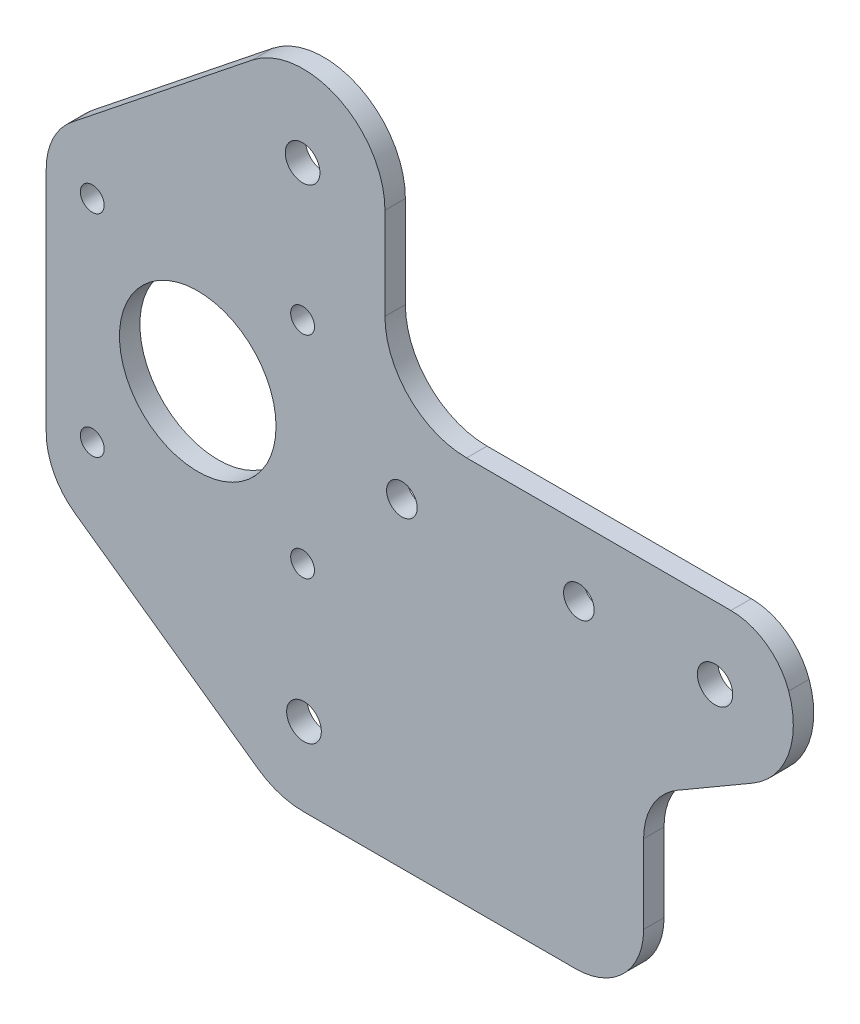
ISO-10303-21;
HEADER;
FILE_DESCRIPTION(('STEP AP214'),'2;1');
FILE_NAME('part.step','',(''),(''),'','','');
FILE_SCHEMA(('AUTOMOTIVE_DESIGN { 1 0 10303 214 1 1 1 1 }'));
ENDSEC;
DATA;
#1=APPLICATION_CONTEXT('core data for automotive mechanical design processes');
#2=APPLICATION_PROTOCOL_DEFINITION('international standard','automotive_design',2000,#1);
#3=PRODUCT_CONTEXT('',#1,'mechanical');
#4=PRODUCT('Part','Part','',(#3));
#5=PRODUCT_RELATED_PRODUCT_CATEGORY('part','',(#4));
#6=PRODUCT_DEFINITION_FORMATION('','',#4);
#7=PRODUCT_DEFINITION_CONTEXT('part definition',#1,'design');
#8=PRODUCT_DEFINITION('design','',#6,#7);
#9=PRODUCT_DEFINITION_SHAPE('','',#8);
#10=(LENGTH_UNIT() NAMED_UNIT(*) SI_UNIT(.MILLI.,.METRE.));
#11=(NAMED_UNIT(*) PLANE_ANGLE_UNIT() SI_UNIT($,.RADIAN.));
#12=(NAMED_UNIT(*) SI_UNIT($,.STERADIAN.) SOLID_ANGLE_UNIT());
#13=UNCERTAINTY_MEASURE_WITH_UNIT(LENGTH_MEASURE(1.E-05),#10,'distance_accuracy_value','');
#14=(GEOMETRIC_REPRESENTATION_CONTEXT(3) GLOBAL_UNCERTAINTY_ASSIGNED_CONTEXT((#13)) GLOBAL_UNIT_ASSIGNED_CONTEXT((#10,
#11,#12)) REPRESENTATION_CONTEXT('',''));
#15=CARTESIAN_POINT('',(0.,0.,0.));
#16=DIRECTION('',(0.,0.,1.));
#17=DIRECTION('',(1.,0.,0.));
#18=AXIS2_PLACEMENT_3D('',#15,#16,#17);
#19=CARTESIAN_POINT('',(20.0949887053272,70.8510693839283,3.));
#20=DIRECTION('',(0.,0.,-1.));
#21=DIRECTION('',(-1.,0.,0.));
#22=AXIS2_PLACEMENT_3D('',#19,#20,#21);
#23=PLANE('',#22);
#24=CARTESIAN_POINT('',(20.0949887053272,70.8510693839283,3.));
#25=DIRECTION('',(0.,0.,1.));
#26=DIRECTION('',(-1.,0.,0.));
#27=AXIS2_PLACEMENT_3D('',#24,#25,#26);
#28=CIRCLE('',#27,12.);
#29=CARTESIAN_POINT('',(32.0949887053272,70.8510693839283,3.));
#30=VERTEX_POINT('',#29);
#31=CARTESIAN_POINT('',(12.6113055582922,80.2316070313547,3.));
#32=VERTEX_POINT('',#31);
#33=EDGE_CURVE('E245',#30,#32,#28,.T.);
#34=ORIENTED_EDGE('',*,*,#33,.T.);
#35=DIRECTION('',(-0.781711470618866,-0.623640262252919,0.));
#36=VECTOR('',#35,1.);
#37=CARTESIAN_POINT('',(-13.9043475250998,59.0777293357357,3.));
#38=LINE('',#37,#36);
#39=CARTESIAN_POINT('',(-13.9043475250998,59.0777293357357,3.));
#40=VERTEX_POINT('',#39);
#41=EDGE_CURVE('E134',#32,#40,#38,.T.);
#42=ORIENTED_EDGE('',*,*,#41,.T.);
#43=CARTESIAN_POINT('',(-7.66794490257056,51.260614629547,3.));
#44=DIRECTION('',(0.,0.,1.));
#45=DIRECTION('',(-1.,0.,0.));
#46=AXIS2_PLACEMENT_3D('',#43,#44,#45);
#47=CIRCLE('',#46,10.);
#48=CARTESIAN_POINT('',(-17.6679449025706,51.260614629547,3.));
#49=VERTEX_POINT('',#48);
#50=EDGE_CURVE('E294',#40,#49,#47,.T.);
#51=ORIENTED_EDGE('',*,*,#50,.T.);
#52=DIRECTION('',(0.,-1.,0.));
#53=VECTOR('',#52,1.);
#54=CARTESIAN_POINT('',(-17.6679449025706,51.260614629547,3.));
#55=LINE('',#54,#53);
#56=CARTESIAN_POINT('',(-17.6679449025706,17.690614629547,3.));
#57=VERTEX_POINT('',#56);
#58=EDGE_CURVE('E313',#49,#57,#55,.T.);
#59=ORIENTED_EDGE('',*,*,#58,.T.);
#60=CARTESIAN_POINT('',(-7.66794490257056,17.690614629547,3.));
#61=DIRECTION('',(0.,0.,1.));
#62=DIRECTION('',(-1.,0.,0.));
#63=AXIS2_PLACEMENT_3D('',#60,#61,#62);
#64=CIRCLE('',#63,10.);
#65=CARTESIAN_POINT('',(-13.4499842307973,9.53169183258174,3.));
#66=VERTEX_POINT('',#65);
#67=EDGE_CURVE('E310',#57,#66,#64,.T.);
#68=ORIENTED_EDGE('',*,*,#67,.T.);
#69=DIRECTION('',(0.815892279696527,-0.578203932822671,0.));
#70=VECTOR('',#69,1.);
#71=CARTESIAN_POINT('',(13.4499842307973,-9.53169183258175,3.));
#72=LINE('',#71,#70);
#73=CARTESIAN_POINT('',(13.4499842307973,-9.53169183258175,3.));
#74=VERTEX_POINT('',#73);
#75=EDGE_CURVE('E312',#66,#74,#72,.T.);
#76=ORIENTED_EDGE('',*,*,#75,.T.);
#77=CARTESIAN_POINT('',(20.099329458258,-0.148930616071687,3.));
#78=DIRECTION('',(0.,0.,1.));
#79=DIRECTION('',(-1.,0.,0.));
#80=AXIS2_PLACEMENT_3D('',#77,#78,#79);
#81=CIRCLE('',#80,11.5);
#82=CARTESIAN_POINT('',(20.099329458258,-11.6489306160717,3.));
#83=VERTEX_POINT('',#82);
#84=EDGE_CURVE('E316',#74,#83,#81,.T.);
#85=ORIENTED_EDGE('',*,*,#84,.T.);
#86=DIRECTION('',(1.,0.,0.));
#87=VECTOR('',#86,1.);
#88=CARTESIAN_POINT('',(60.099329458258,-11.6489306160717,3.));
#89=LINE('',#88,#87);
#90=CARTESIAN_POINT('',(60.099329458258,-11.6489306160717,3.));
#91=VERTEX_POINT('',#90);
#92=EDGE_CURVE('E324',#83,#91,#89,.T.);
#93=ORIENTED_EDGE('',*,*,#92,.T.);
#94=CARTESIAN_POINT('',(60.099329458258,-1.64893061607167,3.));
#95=DIRECTION('',(0.,0.,1.));
#96=DIRECTION('',(-1.,0.,0.));
#97=AXIS2_PLACEMENT_3D('',#94,#95,#96);
#98=CIRCLE('',#97,10.);
#99=CARTESIAN_POINT('',(70.099329458258,-1.64893061607167,3.));
#100=VERTEX_POINT('',#99);
#101=EDGE_CURVE('E327',#91,#100,#98,.T.);
#102=ORIENTED_EDGE('',*,*,#101,.T.);
#103=DIRECTION('',(0.,1.,0.));
#104=VECTOR('',#103,1.);
#105=CARTESIAN_POINT('',(70.099329458258,9.90106938392833,3.));
#106=LINE('',#105,#104);
#107=CARTESIAN_POINT('',(70.099329458258,9.90106938392833,3.));
#108=VERTEX_POINT('',#107);
#109=EDGE_CURVE('E330',#100,#108,#106,.T.);
#110=ORIENTED_EDGE('',*,*,#109,.T.);
#111=CARTESIAN_POINT('',(80.099329458258,9.90106938392833,3.));
#112=DIRECTION('',(0.,0.,-1.));
#113=DIRECTION('',(-1.,0.,0.));
#114=AXIS2_PLACEMENT_3D('',#111,#112,#113);
#115=CIRCLE('',#114,9.99999999999999);
#116=CARTESIAN_POINT('',(75.0691299919557,18.5438174034654,3.));
#117=VERTEX_POINT('',#116);
#118=EDGE_CURVE('E332',#108,#117,#115,.T.);
#119=ORIENTED_EDGE('',*,*,#118,.T.);
#120=DIRECTION('',(0.864274801953706,0.503019946630232,0.));
#121=VECTOR('',#120,1.);
#122=CARTESIAN_POINT('',(86.1318474569631,24.9824727203324,3.));
#123=LINE('',#122,#121);
#124=CARTESIAN_POINT('',(86.1318474569631,24.9824727203324,3.));
#125=VERTEX_POINT('',#124);
#126=EDGE_CURVE('E334',#117,#125,#123,.T.);
#127=ORIENTED_EDGE('',*,*,#126,.T.);
#128=CARTESIAN_POINT('',(80.0956080974003,35.3537703437768,3.));
#129=DIRECTION('',(0.,0.,1.));
#130=DIRECTION('',(-1.,0.,0.));
#131=AXIS2_PLACEMENT_3D('',#128,#129,#130);
#132=CIRCLE('',#131,12.);
#133=CARTESIAN_POINT('',(91.413130529108,39.3429665043828,3.));
#134=VERTEX_POINT('',#133);
#135=EDGE_CURVE('E336',#125,#134,#132,.T.);
#136=ORIENTED_EDGE('',*,*,#135,.T.);
#137=CARTESIAN_POINT('',(82.9249887053272,36.3510693839283,3.));
#138=DIRECTION('',(0.,0.,1.));
#139=DIRECTION('',(-1.,0.,0.));
#140=AXIS2_PLACEMENT_3D('',#137,#138,#139);
#141=CIRCLE('',#140,9.00000000000003);
#142=CARTESIAN_POINT('',(82.9249887053273,45.3510693839284,3.));
#143=VERTEX_POINT('',#142);
#144=EDGE_CURVE('E185',#134,#143,#141,.T.);
#145=ORIENTED_EDGE('',*,*,#144,.T.);
#146=DIRECTION('',(-1.,0.,0.));
#147=VECTOR('',#146,1.);
#148=CARTESIAN_POINT('',(44.0949887053273,45.3510693839283,3.));
#149=LINE('',#148,#147);
#150=CARTESIAN_POINT('',(44.0949887053273,45.3510693839283,3.));
#151=VERTEX_POINT('',#150);
#152=EDGE_CURVE('E179',#143,#151,#149,.T.);
#153=ORIENTED_EDGE('',*,*,#152,.T.);
#154=CARTESIAN_POINT('',(44.0949887053272,57.3510693839283,3.));
#155=DIRECTION('',(0.,0.,-1.));
#156=DIRECTION('',(-1.,0.,0.));
#157=AXIS2_PLACEMENT_3D('',#154,#155,#156);
#158=CIRCLE('',#157,12.);
#159=CARTESIAN_POINT('',(32.0949887053272,57.3510693839283,3.));
#160=VERTEX_POINT('',#159);
#161=EDGE_CURVE('E183',#151,#160,#158,.T.);
#162=ORIENTED_EDGE('',*,*,#161,.T.);
#163=DIRECTION('',(0.,1.,0.));
#164=VECTOR('',#163,1.);
#165=CARTESIAN_POINT('',(32.0949887053272,70.8510693839283,3.));
#166=LINE('',#165,#164);
#167=EDGE_CURVE('E58',#160,#30,#166,.T.);
#168=ORIENTED_EDGE('',*,*,#167,.T.);
#169=EDGE_LOOP('',(#34,#42,#51,#59,#68,#76,#85,#93,#102,#110,#119,#127,#136,#145,#153,#162,#168));
#170=FACE_BOUND('',#169,.T.);
#171=CARTESIAN_POINT('',(60.5847639602232,35.3510693839283,3.));
#172=DIRECTION('',(0.,0.,1.));
#173=DIRECTION('',(1.,0.,0.));
#174=AXIS2_PLACEMENT_3D('',#171,#172,#173);
#175=CIRCLE('',#174,2.24999999999999);
#176=CARTESIAN_POINT('',(62.8347639602232,35.3510693839283,3.));
#177=VERTEX_POINT('',#176);
#178=EDGE_CURVE('E208',#177,#177,#175,.T.);
#179=ORIENTED_EDGE('',*,*,#178,.F.);
#180=EDGE_LOOP('',(#179));
#181=FACE_BOUND('',#180,.T.);
#182=CARTESIAN_POINT('',(80.5947639602231,34.7806705055204,3.));
#183=DIRECTION('',(0.,0.,1.));
#184=DIRECTION('',(1.,0.,0.));
#185=AXIS2_PLACEMENT_3D('',#182,#183,#184);
#186=CIRCLE('',#185,2.6);
#187=CARTESIAN_POINT('',(83.1947639602232,34.7806705055204,3.));
#188=VERTEX_POINT('',#187);
#189=EDGE_CURVE('E467',#188,#188,#186,.T.);
#190=ORIENTED_EDGE('',*,*,#189,.F.);
#191=EDGE_LOOP('',(#190));
#192=FACE_BOUND('',#191,.T.);
#193=CARTESIAN_POINT('',(4.59205509742945,35.3482997800071,3.));
#194=DIRECTION('',(0.,0.,1.));
#195=DIRECTION('',(1.,0.,0.));
#196=AXIS2_PLACEMENT_3D('',#193,#194,#195);
#197=CIRCLE('',#196,11.5);
#198=CARTESIAN_POINT('',(16.0920550974295,35.3482997800071,3.));
#199=VERTEX_POINT('',#198);
#200=EDGE_CURVE('E459',#199,#199,#197,.T.);
#201=ORIENTED_EDGE('',*,*,#200,.F.);
#202=EDGE_LOOP('',(#201));
#203=FACE_BOUND('',#202,.T.);
#204=CARTESIAN_POINT('',(19.9949887541267,70.8509705917557,3.));
#205=DIRECTION('',(0.,0.,1.));
#206=DIRECTION('',(1.,0.,0.));
#207=AXIS2_PLACEMENT_3D('',#204,#205,#206);
#208=CIRCLE('',#207,2.54999999999999);
#209=CARTESIAN_POINT('',(22.5449887541267,70.8509705917557,3.));
#210=VERTEX_POINT('',#209);
#211=EDGE_CURVE('E453',#210,#210,#208,.T.);
#212=ORIENTED_EDGE('',*,*,#211,.F.);
#213=EDGE_LOOP('',(#212));
#214=FACE_BOUND('',#213,.T.);
#215=CARTESIAN_POINT('',(34.5847657629751,35.3413872820056,3.));
#216=DIRECTION('',(0.,0.,1.));
#217=DIRECTION('',(1.,0.,0.));
#218=AXIS2_PLACEMENT_3D('',#215,#216,#217);
#219=CIRCLE('',#218,2.25090238289014);
#220=CARTESIAN_POINT('',(36.8356681458653,35.3413872820056,3.));
#221=VERTEX_POINT('',#220);
#222=EDGE_CURVE('E447',#221,#221,#219,.T.);
#223=ORIENTED_EDGE('',*,*,#222,.F.);
#224=EDGE_LOOP('',(#223));
#225=FACE_BOUND('',#224,.T.);
#226=CARTESIAN_POINT('',(20.1993294094585,-0.149029408244336,3.));
#227=DIRECTION('',(0.,0.,1.));
#228=DIRECTION('',(1.,0.,0.));
#229=AXIS2_PLACEMENT_3D('',#226,#227,#228);
#230=CIRCLE('',#229,2.55);
#231=CARTESIAN_POINT('',(22.7493294094585,-0.149029408244336,3.));
#232=VERTEX_POINT('',#231);
#233=EDGE_CURVE('E439',#232,#232,#230,.T.);
#234=ORIENTED_EDGE('',*,*,#233,.F.);
#235=EDGE_LOOP('',(#234));
#236=FACE_BOUND('',#235,.T.);
#237=CARTESIAN_POINT('',(19.9920550974294,19.8510693839283,3.));
#238=DIRECTION('',(0.,0.,1.));
#239=DIRECTION('',(1.,0.,0.));
#240=AXIS2_PLACEMENT_3D('',#237,#238,#239);
#241=CIRCLE('',#240,1.75);
#242=CARTESIAN_POINT('',(21.7420550974294,19.8510693839283,3.));
#243=VERTEX_POINT('',#242);
#244=EDGE_CURVE('E433',#243,#243,#241,.T.);
#245=ORIENTED_EDGE('',*,*,#244,.F.);
#246=EDGE_LOOP('',(#245));
#247=FACE_BOUND('',#246,.T.);
#248=CARTESIAN_POINT('',(-10.9079449025705,19.8510693839283,3.));
#249=DIRECTION('',(0.,0.,1.));
#250=DIRECTION('',(1.,0.,0.));
#251=AXIS2_PLACEMENT_3D('',#248,#249,#250);
#252=CIRCLE('',#251,1.75);
#253=CARTESIAN_POINT('',(-9.15794490257054,19.8510693839283,3.));
#254=VERTEX_POINT('',#253);
#255=EDGE_CURVE('E427',#254,#254,#252,.T.);
#256=ORIENTED_EDGE('',*,*,#255,.F.);
#257=EDGE_LOOP('',(#256));
#258=FACE_BOUND('',#257,.T.);
#259=CARTESIAN_POINT('',(-10.9079449025705,50.8510693839283,3.));
#260=DIRECTION('',(0.,0.,1.));
#261=DIRECTION('',(1.,0.,0.));
#262=AXIS2_PLACEMENT_3D('',#259,#260,#261);
#263=CIRCLE('',#262,1.75);
#264=CARTESIAN_POINT('',(-9.15794490257054,50.8510693839283,3.));
#265=VERTEX_POINT('',#264);
#266=EDGE_CURVE('E419',#265,#265,#263,.T.);
#267=ORIENTED_EDGE('',*,*,#266,.F.);
#268=EDGE_LOOP('',(#267));
#269=FACE_BOUND('',#268,.T.);
#270=CARTESIAN_POINT('',(19.9920550974294,50.8510693839283,3.));
#271=DIRECTION('',(0.,0.,1.));
#272=DIRECTION('',(1.,0.,0.));
#273=AXIS2_PLACEMENT_3D('',#270,#271,#272);
#274=CIRCLE('',#273,1.75);
#275=CARTESIAN_POINT('',(21.7420550974294,50.8510693839283,3.));
#276=VERTEX_POINT('',#275);
#277=EDGE_CURVE('E409',#276,#276,#274,.T.);
#278=ORIENTED_EDGE('',*,*,#277,.F.);
#279=EDGE_LOOP('',(#278));
#280=FACE_BOUND('',#279,.T.);
#281=ADVANCED_FACE('F40',(#170,#181,#192,#203,#214,#225,#236,#247,#258,#269,#280),#23,.F.);
#282=CARTESIAN_POINT('',(20.0949887053272,70.8510693839283,0.));
#283=DIRECTION('',(0.,0.,-1.));
#284=DIRECTION('',(-1.,0.,0.));
#285=AXIS2_PLACEMENT_3D('',#282,#283,#284);
#286=PLANE('',#285);
#287=CARTESIAN_POINT('',(-10.9079449025705,50.8510693839283,0.));
#288=DIRECTION('',(0.,0.,1.));
#289=DIRECTION('',(1.,0.,0.));
#290=AXIS2_PLACEMENT_3D('',#287,#288,#289);
#291=CIRCLE('',#290,1.75);
#292=CARTESIAN_POINT('',(-9.15794490257054,50.8510693839283,0.));
#293=VERTEX_POINT('',#292);
#294=EDGE_CURVE('E416',#293,#293,#291,.T.);
#295=ORIENTED_EDGE('',*,*,#294,.T.);
#296=EDGE_LOOP('',(#295));
#297=FACE_BOUND('',#296,.T.);
#298=CARTESIAN_POINT('',(19.9920550974294,19.8510693839283,0.));
#299=DIRECTION('',(0.,0.,1.));
#300=DIRECTION('',(1.,0.,0.));
#301=AXIS2_PLACEMENT_3D('',#298,#299,#300);
#302=CIRCLE('',#301,1.75);
#303=CARTESIAN_POINT('',(21.7420550974294,19.8510693839283,0.));
#304=VERTEX_POINT('',#303);
#305=EDGE_CURVE('E430',#304,#304,#302,.T.);
#306=ORIENTED_EDGE('',*,*,#305,.T.);
#307=EDGE_LOOP('',(#306));
#308=FACE_BOUND('',#307,.T.);
#309=CARTESIAN_POINT('',(34.5847657629751,35.3413872820056,0.));
#310=DIRECTION('',(0.,0.,1.));
#311=DIRECTION('',(1.,0.,0.));
#312=AXIS2_PLACEMENT_3D('',#309,#310,#311);
#313=CIRCLE('',#312,2.25090238289014);
#314=CARTESIAN_POINT('',(36.8356681458653,35.3413872820056,0.));
#315=VERTEX_POINT('',#314);
#316=EDGE_CURVE('E443',#315,#315,#313,.T.);
#317=ORIENTED_EDGE('',*,*,#316,.T.);
#318=EDGE_LOOP('',(#317));
#319=FACE_BOUND('',#318,.T.);
#320=CARTESIAN_POINT('',(4.59205509742945,35.3482997800071,0.));
#321=DIRECTION('',(0.,0.,1.));
#322=DIRECTION('',(1.,0.,0.));
#323=AXIS2_PLACEMENT_3D('',#320,#321,#322);
#324=CIRCLE('',#323,11.5);
#325=CARTESIAN_POINT('',(16.0920550974295,35.3482997800071,0.));
#326=VERTEX_POINT('',#325);
#327=EDGE_CURVE('E456',#326,#326,#324,.T.);
#328=ORIENTED_EDGE('',*,*,#327,.T.);
#329=EDGE_LOOP('',(#328));
#330=FACE_BOUND('',#329,.T.);
#331=CARTESIAN_POINT('',(60.5847639602232,35.3510693839283,0.));
#332=DIRECTION('',(0.,0.,1.));
#333=DIRECTION('',(1.,0.,0.));
#334=AXIS2_PLACEMENT_3D('',#331,#332,#333);
#335=CIRCLE('',#334,2.24999999999999);
#336=CARTESIAN_POINT('',(62.8347639602232,35.3510693839283,0.));
#337=VERTEX_POINT('',#336);
#338=EDGE_CURVE('E470',#337,#337,#335,.T.);
#339=ORIENTED_EDGE('',*,*,#338,.T.);
#340=EDGE_LOOP('',(#339));
#341=FACE_BOUND('',#340,.T.);
#342=CARTESIAN_POINT('',(20.0949887053272,70.8510693839283,0.));
#343=DIRECTION('',(0.,0.,1.));
#344=DIRECTION('',(-1.,0.,0.));
#345=AXIS2_PLACEMENT_3D('',#342,#343,#344);
#346=CIRCLE('',#345,12.);
#347=CARTESIAN_POINT('',(32.0949887053272,70.8510693839283,0.));
#348=VERTEX_POINT('',#347);
#349=CARTESIAN_POINT('',(12.6113055582922,80.2316070313547,0.));
#350=VERTEX_POINT('',#349);
#351=EDGE_CURVE('E204',#348,#350,#346,.T.);
#352=ORIENTED_EDGE('',*,*,#351,.F.);
#353=DIRECTION('',(0.,1.,0.));
#354=VECTOR('',#353,1.);
#355=CARTESIAN_POINT('',(32.0949887053272,70.8510693839283,0.));
#356=LINE('',#355,#354);
#357=CARTESIAN_POINT('',(32.0949887053272,57.3510693839283,0.));
#358=VERTEX_POINT('',#357);
#359=EDGE_CURVE('E125',#358,#348,#356,.T.);
#360=ORIENTED_EDGE('',*,*,#359,.F.);
#361=CARTESIAN_POINT('',(44.0949887053272,57.3510693839283,0.));
#362=DIRECTION('',(0.,0.,-1.));
#363=DIRECTION('',(-1.,0.,0.));
#364=AXIS2_PLACEMENT_3D('',#361,#362,#363);
#365=CIRCLE('',#364,12.);
#366=CARTESIAN_POINT('',(44.0949887053273,45.3510693839283,0.));
#367=VERTEX_POINT('',#366);
#368=EDGE_CURVE('E119',#367,#358,#365,.T.);
#369=ORIENTED_EDGE('',*,*,#368,.F.);
#370=DIRECTION('',(-1.,0.,0.));
#371=VECTOR('',#370,1.);
#372=CARTESIAN_POINT('',(44.0949887053273,45.3510693839283,0.));
#373=LINE('',#372,#371);
#374=CARTESIAN_POINT('',(82.9249887053273,45.3510693839284,0.));
#375=VERTEX_POINT('',#374);
#376=EDGE_CURVE('E194',#375,#367,#373,.T.);
#377=ORIENTED_EDGE('',*,*,#376,.F.);
#378=CARTESIAN_POINT('',(82.9249887053272,36.3510693839283,0.));
#379=DIRECTION('',(0.,0.,1.));
#380=DIRECTION('',(-1.,0.,0.));
#381=AXIS2_PLACEMENT_3D('',#378,#379,#380);
#382=CIRCLE('',#381,9.00000000000003);
#383=CARTESIAN_POINT('',(91.413130529108,39.3429665043828,0.));
#384=VERTEX_POINT('',#383);
#385=EDGE_CURVE('E239',#384,#375,#382,.T.);
#386=ORIENTED_EDGE('',*,*,#385,.F.);
#387=CARTESIAN_POINT('',(80.0956080974003,35.3537703437768,0.));
#388=DIRECTION('',(0.,0.,1.));
#389=DIRECTION('',(-1.,0.,0.));
#390=AXIS2_PLACEMENT_3D('',#387,#388,#389);
#391=CIRCLE('',#390,12.);
#392=CARTESIAN_POINT('',(86.1318474569631,24.9824727203324,0.));
#393=VERTEX_POINT('',#392);
#394=EDGE_CURVE('E237',#393,#384,#391,.T.);
#395=ORIENTED_EDGE('',*,*,#394,.F.);
#396=DIRECTION('',(0.864274801953706,0.503019946630232,0.));
#397=VECTOR('',#396,1.);
#398=CARTESIAN_POINT('',(86.1318474569631,24.9824727203324,0.));
#399=LINE('',#398,#397);
#400=CARTESIAN_POINT('',(75.0691299919557,18.5438174034654,0.));
#401=VERTEX_POINT('',#400);
#402=EDGE_CURVE('E235',#401,#393,#399,.T.);
#403=ORIENTED_EDGE('',*,*,#402,.F.);
#404=CARTESIAN_POINT('',(80.099329458258,9.90106938392833,0.));
#405=DIRECTION('',(0.,0.,-1.));
#406=DIRECTION('',(-1.,0.,0.));
#407=AXIS2_PLACEMENT_3D('',#404,#405,#406);
#408=CIRCLE('',#407,9.99999999999999);
#409=CARTESIAN_POINT('',(70.099329458258,9.90106938392833,0.));
#410=VERTEX_POINT('',#409);
#411=EDGE_CURVE('E233',#410,#401,#408,.T.);
#412=ORIENTED_EDGE('',*,*,#411,.F.);
#413=DIRECTION('',(0.,1.,0.));
#414=VECTOR('',#413,1.);
#415=CARTESIAN_POINT('',(70.099329458258,9.90106938392833,0.));
#416=LINE('',#415,#414);
#417=CARTESIAN_POINT('',(70.099329458258,-1.64893061607167,0.));
#418=VERTEX_POINT('',#417);
#419=EDGE_CURVE('E231',#418,#410,#416,.T.);
#420=ORIENTED_EDGE('',*,*,#419,.F.);
#421=CARTESIAN_POINT('',(60.099329458258,-1.64893061607167,0.));
#422=DIRECTION('',(0.,0.,1.));
#423=DIRECTION('',(-1.,0.,0.));
#424=AXIS2_PLACEMENT_3D('',#421,#422,#423);
#425=CIRCLE('',#424,10.);
#426=CARTESIAN_POINT('',(60.099329458258,-11.6489306160717,0.));
#427=VERTEX_POINT('',#426);
#428=EDGE_CURVE('E228',#427,#418,#425,.T.);
#429=ORIENTED_EDGE('',*,*,#428,.F.);
#430=DIRECTION('',(1.,0.,0.));
#431=VECTOR('',#430,1.);
#432=CARTESIAN_POINT('',(60.099329458258,-11.6489306160717,0.));
#433=LINE('',#432,#431);
#434=CARTESIAN_POINT('',(20.099329458258,-11.6489306160717,0.));
#435=VERTEX_POINT('',#434);
#436=EDGE_CURVE('E225',#435,#427,#433,.T.);
#437=ORIENTED_EDGE('',*,*,#436,.F.);
#438=CARTESIAN_POINT('',(20.099329458258,-0.148930616071687,0.));
#439=DIRECTION('',(0.,0.,1.));
#440=DIRECTION('',(-1.,0.,0.));
#441=AXIS2_PLACEMENT_3D('',#438,#439,#440);
#442=CIRCLE('',#441,11.5);
#443=CARTESIAN_POINT('',(13.4499842307973,-9.53169183258175,0.));
#444=VERTEX_POINT('',#443);
#445=EDGE_CURVE('E222',#444,#435,#442,.T.);
#446=ORIENTED_EDGE('',*,*,#445,.F.);
#447=DIRECTION('',(0.815892279696527,-0.578203932822671,0.));
#448=VECTOR('',#447,1.);
#449=CARTESIAN_POINT('',(13.4499842307973,-9.53169183258175,0.));
#450=LINE('',#449,#448);
#451=CARTESIAN_POINT('',(-13.4499842307973,9.53169183258174,0.));
#452=VERTEX_POINT('',#451);
#453=EDGE_CURVE('E219',#452,#444,#450,.T.);
#454=ORIENTED_EDGE('',*,*,#453,.F.);
#455=CARTESIAN_POINT('',(-7.66794490257056,17.690614629547,0.));
#456=DIRECTION('',(0.,0.,1.));
#457=DIRECTION('',(-1.,0.,0.));
#458=AXIS2_PLACEMENT_3D('',#455,#456,#457);
#459=CIRCLE('',#458,10.);
#460=CARTESIAN_POINT('',(-17.6679449025706,17.690614629547,0.));
#461=VERTEX_POINT('',#460);
#462=EDGE_CURVE('E217',#461,#452,#459,.T.);
#463=ORIENTED_EDGE('',*,*,#462,.F.);
#464=DIRECTION('',(0.,-1.,0.));
#465=VECTOR('',#464,1.);
#466=CARTESIAN_POINT('',(-17.6679449025706,51.260614629547,0.));
#467=LINE('',#466,#465);
#468=CARTESIAN_POINT('',(-17.6679449025706,51.260614629547,0.));
#469=VERTEX_POINT('',#468);
#470=EDGE_CURVE('E214',#469,#461,#467,.T.);
#471=ORIENTED_EDGE('',*,*,#470,.F.);
#472=CARTESIAN_POINT('',(-7.66794490257056,51.260614629547,0.));
#473=DIRECTION('',(0.,0.,1.));
#474=DIRECTION('',(-1.,0.,0.));
#475=AXIS2_PLACEMENT_3D('',#472,#473,#474);
#476=CIRCLE('',#475,10.);
#477=CARTESIAN_POINT('',(-13.9043475250998,59.0777293357357,0.));
#478=VERTEX_POINT('',#477);
#479=EDGE_CURVE('E211',#478,#469,#476,.T.);
#480=ORIENTED_EDGE('',*,*,#479,.F.);
#481=DIRECTION('',(-0.781711470618866,-0.623640262252919,0.));
#482=VECTOR('',#481,1.);
#483=CARTESIAN_POINT('',(-13.9043475250998,59.0777293357357,0.));
#484=LINE('',#483,#482);
#485=EDGE_CURVE('E207',#350,#478,#484,.T.);
#486=ORIENTED_EDGE('',*,*,#485,.F.);
#487=EDGE_LOOP('',(#352,#360,#369,#377,#386,#395,#403,#412,#420,#429,#437,#446,#454,#463,#471,
#480,#486));
#488=FACE_BOUND('',#487,.T.);
#489=CARTESIAN_POINT('',(80.5947639602231,34.7806705055204,0.));
#490=DIRECTION('',(0.,0.,1.));
#491=DIRECTION('',(1.,0.,0.));
#492=AXIS2_PLACEMENT_3D('',#489,#490,#491);
#493=CIRCLE('',#492,2.6);
#494=CARTESIAN_POINT('',(83.1947639602232,34.7806705055204,0.));
#495=VERTEX_POINT('',#494);
#496=EDGE_CURVE('E463',#495,#495,#493,.T.);
#497=ORIENTED_EDGE('',*,*,#496,.T.);
#498=EDGE_LOOP('',(#497));
#499=FACE_BOUND('',#498,.T.);
#500=CARTESIAN_POINT('',(19.9949887541267,70.8509705917557,0.));
#501=DIRECTION('',(0.,0.,1.));
#502=DIRECTION('',(1.,0.,0.));
#503=AXIS2_PLACEMENT_3D('',#500,#501,#502);
#504=CIRCLE('',#503,2.54999999999999);
#505=CARTESIAN_POINT('',(22.5449887541267,70.8509705917557,0.));
#506=VERTEX_POINT('',#505);
#507=EDGE_CURVE('E450',#506,#506,#504,.T.);
#508=ORIENTED_EDGE('',*,*,#507,.T.);
#509=EDGE_LOOP('',(#508));
#510=FACE_BOUND('',#509,.T.);
#511=CARTESIAN_POINT('',(20.1993294094585,-0.149029408244336,0.));
#512=DIRECTION('',(0.,0.,1.));
#513=DIRECTION('',(1.,0.,0.));
#514=AXIS2_PLACEMENT_3D('',#511,#512,#513);
#515=CIRCLE('',#514,2.55);
#516=CARTESIAN_POINT('',(22.7493294094585,-0.149029408244336,0.));
#517=VERTEX_POINT('',#516);
#518=EDGE_CURVE('E436',#517,#517,#515,.T.);
#519=ORIENTED_EDGE('',*,*,#518,.T.);
#520=EDGE_LOOP('',(#519));
#521=FACE_BOUND('',#520,.T.);
#522=CARTESIAN_POINT('',(-10.9079449025705,19.8510693839283,0.));
#523=DIRECTION('',(0.,0.,1.));
#524=DIRECTION('',(1.,0.,0.));
#525=AXIS2_PLACEMENT_3D('',#522,#523,#524);
#526=CIRCLE('',#525,1.75);
#527=CARTESIAN_POINT('',(-9.15794490257054,19.8510693839283,0.));
#528=VERTEX_POINT('',#527);
#529=EDGE_CURVE('E423',#528,#528,#526,.T.);
#530=ORIENTED_EDGE('',*,*,#529,.T.);
#531=EDGE_LOOP('',(#530));
#532=FACE_BOUND('',#531,.T.);
#533=CARTESIAN_POINT('',(19.9920550974294,50.8510693839283,0.));
#534=DIRECTION('',(0.,0.,1.));
#535=DIRECTION('',(1.,0.,0.));
#536=AXIS2_PLACEMENT_3D('',#533,#534,#535);
#537=CIRCLE('',#536,1.75);
#538=CARTESIAN_POINT('',(21.7420550974294,50.8510693839283,0.));
#539=VERTEX_POINT('',#538);
#540=EDGE_CURVE('E412',#539,#539,#537,.T.);
#541=ORIENTED_EDGE('',*,*,#540,.T.);
#542=EDGE_LOOP('',(#541));
#543=FACE_BOUND('',#542,.T.);
#544=ADVANCED_FACE('F298',(#297,#308,#319,#330,#341,#488,#499,#510,#521,#532,#543),#286,.T.);
#545=CARTESIAN_POINT('',(20.0949887053272,70.8510693839283,3.));
#546=DIRECTION('',(0.,0.,-1.));
#547=DIRECTION('',(-1.,0.,0.));
#548=AXIS2_PLACEMENT_3D('',#545,#546,#547);
#549=CYLINDRICAL_SURFACE('',#548,12.);
#550=ORIENTED_EDGE('',*,*,#351,.T.);
#551=DIRECTION('',(0.,0.,-1.));
#552=VECTOR('',#551,1.);
#553=CARTESIAN_POINT('',(12.6113055582922,80.2316070313547,3.));
#554=LINE('',#553,#552);
#555=EDGE_CURVE('E11',#32,#350,#554,.T.);
#556=ORIENTED_EDGE('',*,*,#555,.F.);
#557=ORIENTED_EDGE('',*,*,#33,.F.);
#558=DIRECTION('',(0.,0.,-1.));
#559=VECTOR('',#558,1.);
#560=CARTESIAN_POINT('',(32.0949887053272,70.8510693839283,3.));
#561=LINE('',#560,#559);
#562=EDGE_CURVE('E200',#30,#348,#561,.T.);
#563=ORIENTED_EDGE('',*,*,#562,.T.);
#564=EDGE_LOOP('',(#550,#556,#557,#563));
#565=FACE_BOUND('',#564,.T.);
#566=ADVANCED_FACE('F42',(#565),#549,.T.);
#567=CARTESIAN_POINT('',(-13.9043475250998,59.0777293357357,3.));
#568=DIRECTION('',(0.623640262252919,-0.781711470618866,0.));
#569=DIRECTION('',(0.781711470618866,0.623640262252919,0.));
#570=AXIS2_PLACEMENT_3D('',#567,#568,#569);
#571=PLANE('',#570);
#572=ORIENTED_EDGE('',*,*,#485,.T.);
#573=DIRECTION('',(0.,0.,-1.));
#574=VECTOR('',#573,1.);
#575=CARTESIAN_POINT('',(-13.9043475250998,59.0777293357357,3.));
#576=LINE('',#575,#574);
#577=EDGE_CURVE('E50',#40,#478,#576,.T.);
#578=ORIENTED_EDGE('',*,*,#577,.F.);
#579=ORIENTED_EDGE('',*,*,#41,.F.);
#580=ORIENTED_EDGE('',*,*,#555,.T.);
#581=EDGE_LOOP('',(#572,#578,#579,#580));
#582=FACE_BOUND('',#581,.T.);
#583=ADVANCED_FACE('F711',(#582),#571,.F.);
#584=CARTESIAN_POINT('',(-7.66794490257056,51.260614629547,3.));
#585=DIRECTION('',(0.,0.,-1.));
#586=DIRECTION('',(-1.,0.,0.));
#587=AXIS2_PLACEMENT_3D('',#584,#585,#586);
#588=CYLINDRICAL_SURFACE('',#587,10.);
#589=ORIENTED_EDGE('',*,*,#479,.T.);
#590=DIRECTION('',(0.,0.,-1.));
#591=VECTOR('',#590,1.);
#592=CARTESIAN_POINT('',(-17.6679449025706,51.260614629547,3.));
#593=LINE('',#592,#591);
#594=EDGE_CURVE('E282',#49,#469,#593,.T.);
#595=ORIENTED_EDGE('',*,*,#594,.F.);
#596=ORIENTED_EDGE('',*,*,#50,.F.);
#597=ORIENTED_EDGE('',*,*,#577,.T.);
#598=EDGE_LOOP('',(#589,#595,#596,#597));
#599=FACE_BOUND('',#598,.T.);
#600=ADVANCED_FACE('F292',(#599),#588,.T.);
#601=CARTESIAN_POINT('',(-17.6679449025706,51.260614629547,3.));
#602=DIRECTION('',(1.,0.,0.));
#603=DIRECTION('',(0.,1.,0.));
#604=AXIS2_PLACEMENT_3D('',#601,#602,#603);
#605=PLANE('',#604);
#606=ORIENTED_EDGE('',*,*,#470,.T.);
#607=DIRECTION('',(0.,0.,-1.));
#608=VECTOR('',#607,1.);
#609=CARTESIAN_POINT('',(-17.6679449025706,17.690614629547,3.));
#610=LINE('',#609,#608);
#611=EDGE_CURVE('E279',#57,#461,#610,.T.);
#612=ORIENTED_EDGE('',*,*,#611,.F.);
#613=ORIENTED_EDGE('',*,*,#58,.F.);
#614=ORIENTED_EDGE('',*,*,#594,.T.);
#615=EDGE_LOOP('',(#606,#612,#613,#614));
#616=FACE_BOUND('',#615,.T.);
#617=ADVANCED_FACE('F304',(#616),#605,.F.);
#618=CARTESIAN_POINT('',(-7.66794490257056,17.690614629547,3.));
#619=DIRECTION('',(0.,0.,-1.));
#620=DIRECTION('',(-1.,0.,0.));
#621=AXIS2_PLACEMENT_3D('',#618,#619,#620);
#622=CYLINDRICAL_SURFACE('',#621,10.);
#623=ORIENTED_EDGE('',*,*,#462,.T.);
#624=DIRECTION('',(0.,0.,-1.));
#625=VECTOR('',#624,1.);
#626=CARTESIAN_POINT('',(-13.4499842307973,9.53169183258174,3.));
#627=LINE('',#626,#625);
#628=EDGE_CURVE('E276',#66,#452,#627,.T.);
#629=ORIENTED_EDGE('',*,*,#628,.F.);
#630=ORIENTED_EDGE('',*,*,#67,.F.);
#631=ORIENTED_EDGE('',*,*,#611,.T.);
#632=EDGE_LOOP('',(#623,#629,#630,#631));
#633=FACE_BOUND('',#632,.T.);
#634=ADVANCED_FACE('F308',(#633),#622,.T.);
#635=CARTESIAN_POINT('',(13.4499842307973,-9.53169183258175,3.));
#636=DIRECTION('',(0.578203932822671,0.815892279696527,0.));
#637=DIRECTION('',(-0.815892279696527,0.578203932822671,0.));
#638=AXIS2_PLACEMENT_3D('',#635,#636,#637);
#639=PLANE('',#638);
#640=ORIENTED_EDGE('',*,*,#453,.T.);
#641=DIRECTION('',(0.,0.,-1.));
#642=VECTOR('',#641,1.);
#643=CARTESIAN_POINT('',(13.4499842307973,-9.53169183258175,3.));
#644=LINE('',#643,#642);
#645=EDGE_CURVE('E272',#74,#444,#644,.T.);
#646=ORIENTED_EDGE('',*,*,#645,.F.);
#647=ORIENTED_EDGE('',*,*,#75,.F.);
#648=ORIENTED_EDGE('',*,*,#628,.T.);
#649=EDGE_LOOP('',(#640,#646,#647,#648));
#650=FACE_BOUND('',#649,.T.);
#651=ADVANCED_FACE('F568',(#650),#639,.F.);
#652=CARTESIAN_POINT('',(20.099329458258,-0.148930616071687,3.));
#653=DIRECTION('',(0.,0.,-1.));
#654=DIRECTION('',(-1.,0.,0.));
#655=AXIS2_PLACEMENT_3D('',#652,#653,#654);
#656=CYLINDRICAL_SURFACE('',#655,11.5);
#657=ORIENTED_EDGE('',*,*,#445,.T.);
#658=DIRECTION('',(0.,0.,-1.));
#659=VECTOR('',#658,1.);
#660=CARTESIAN_POINT('',(20.099329458258,-11.6489306160717,3.));
#661=LINE('',#660,#659);
#662=EDGE_CURVE('E268',#83,#435,#661,.T.);
#663=ORIENTED_EDGE('',*,*,#662,.F.);
#664=ORIENTED_EDGE('',*,*,#84,.F.);
#665=ORIENTED_EDGE('',*,*,#645,.T.);
#666=EDGE_LOOP('',(#657,#663,#664,#665));
#667=FACE_BOUND('',#666,.T.);
#668=ADVANCED_FACE('F572',(#667),#656,.T.);
#669=CARTESIAN_POINT('',(60.099329458258,-11.6489306160717,3.));
#670=DIRECTION('',(0.,1.,0.));
#671=DIRECTION('',(-1.,0.,0.));
#672=AXIS2_PLACEMENT_3D('',#669,#670,#671);
#673=PLANE('',#672);
#674=ORIENTED_EDGE('',*,*,#436,.T.);
#675=DIRECTION('',(0.,0.,-1.));
#676=VECTOR('',#675,1.);
#677=CARTESIAN_POINT('',(60.099329458258,-11.6489306160717,3.));
#678=LINE('',#677,#676);
#679=EDGE_CURVE('E264',#91,#427,#678,.T.);
#680=ORIENTED_EDGE('',*,*,#679,.F.);
#681=ORIENTED_EDGE('',*,*,#92,.F.);
#682=ORIENTED_EDGE('',*,*,#662,.T.);
#683=EDGE_LOOP('',(#674,#680,#681,#682));
#684=FACE_BOUND('',#683,.T.);
#685=ADVANCED_FACE('F582',(#684),#673,.F.);
#686=CARTESIAN_POINT('',(60.099329458258,-1.64893061607167,3.));
#687=DIRECTION('',(0.,0.,-1.));
#688=DIRECTION('',(-1.,0.,0.));
#689=AXIS2_PLACEMENT_3D('',#686,#687,#688);
#690=CYLINDRICAL_SURFACE('',#689,10.);
#691=ORIENTED_EDGE('',*,*,#428,.T.);
#692=DIRECTION('',(0.,0.,-1.));
#693=VECTOR('',#692,1.);
#694=CARTESIAN_POINT('',(70.099329458258,-1.64893061607167,3.));
#695=LINE('',#694,#693);
#696=EDGE_CURVE('E261',#100,#418,#695,.T.);
#697=ORIENTED_EDGE('',*,*,#696,.F.);
#698=ORIENTED_EDGE('',*,*,#101,.F.);
#699=ORIENTED_EDGE('',*,*,#679,.T.);
#700=EDGE_LOOP('',(#691,#697,#698,#699));
#701=FACE_BOUND('',#700,.T.);
#702=ADVANCED_FACE('F592',(#701),#690,.T.);
#703=CARTESIAN_POINT('',(70.099329458258,9.90106938392833,3.));
#704=DIRECTION('',(-1.,0.,0.));
#705=DIRECTION('',(0.,-1.,0.));
#706=AXIS2_PLACEMENT_3D('',#703,#704,#705);
#707=PLANE('',#706);
#708=ORIENTED_EDGE('',*,*,#419,.T.);
#709=DIRECTION('',(0.,0.,-1.));
#710=VECTOR('',#709,1.);
#711=CARTESIAN_POINT('',(70.099329458258,9.90106938392833,3.));
#712=LINE('',#711,#710);
#713=EDGE_CURVE('E258',#108,#410,#712,.T.);
#714=ORIENTED_EDGE('',*,*,#713,.F.);
#715=ORIENTED_EDGE('',*,*,#109,.F.);
#716=ORIENTED_EDGE('',*,*,#696,.T.);
#717=EDGE_LOOP('',(#708,#714,#715,#716));
#718=FACE_BOUND('',#717,.T.);
#719=ADVANCED_FACE('F600',(#718),#707,.F.);
#720=CARTESIAN_POINT('',(80.099329458258,9.90106938392833,3.));
#721=DIRECTION('',(0.,0.,-1.));
#722=DIRECTION('',(-1.,0.,0.));
#723=AXIS2_PLACEMENT_3D('',#720,#721,#722);
#724=CYLINDRICAL_SURFACE('',#723,9.99999999999999);
#725=ORIENTED_EDGE('',*,*,#411,.T.);
#726=DIRECTION('',(0.,0.,-1.));
#727=VECTOR('',#726,1.);
#728=CARTESIAN_POINT('',(75.0691299919557,18.5438174034654,3.));
#729=LINE('',#728,#727);
#730=EDGE_CURVE('E255',#117,#401,#729,.T.);
#731=ORIENTED_EDGE('',*,*,#730,.F.);
#732=ORIENTED_EDGE('',*,*,#118,.F.);
#733=ORIENTED_EDGE('',*,*,#713,.T.);
#734=EDGE_LOOP('',(#725,#731,#732,#733));
#735=FACE_BOUND('',#734,.T.);
#736=ADVANCED_FACE('F608',(#735),#724,.F.);
#737=CARTESIAN_POINT('',(86.1318474569631,24.9824727203324,3.));
#738=DIRECTION('',(-0.503019946630232,0.864274801953706,0.));
#739=DIRECTION('',(-0.864274801953707,-0.503019946630232,0.));
#740=AXIS2_PLACEMENT_3D('',#737,#738,#739);
#741=PLANE('',#740);
#742=ORIENTED_EDGE('',*,*,#402,.T.);
#743=DIRECTION('',(0.,0.,-1.));
#744=VECTOR('',#743,1.);
#745=CARTESIAN_POINT('',(86.1318474569631,24.9824727203324,3.));
#746=LINE('',#745,#744);
#747=EDGE_CURVE('E252',#125,#393,#746,.T.);
#748=ORIENTED_EDGE('',*,*,#747,.F.);
#749=ORIENTED_EDGE('',*,*,#126,.F.);
#750=ORIENTED_EDGE('',*,*,#730,.T.);
#751=EDGE_LOOP('',(#742,#748,#749,#750));
#752=FACE_BOUND('',#751,.T.);
#753=ADVANCED_FACE('F616',(#752),#741,.F.);
#754=CARTESIAN_POINT('',(80.0956080974003,35.3537703437768,3.));
#755=DIRECTION('',(0.,0.,-1.));
#756=DIRECTION('',(-1.,0.,0.));
#757=AXIS2_PLACEMENT_3D('',#754,#755,#756);
#758=CYLINDRICAL_SURFACE('',#757,12.);
#759=ORIENTED_EDGE('',*,*,#394,.T.);
#760=DIRECTION('',(0.,0.,-1.));
#761=VECTOR('',#760,1.);
#762=CARTESIAN_POINT('',(91.413130529108,39.3429665043828,3.));
#763=LINE('',#762,#761);
#764=EDGE_CURVE('E249',#134,#384,#763,.T.);
#765=ORIENTED_EDGE('',*,*,#764,.F.);
#766=ORIENTED_EDGE('',*,*,#135,.F.);
#767=ORIENTED_EDGE('',*,*,#747,.T.);
#768=EDGE_LOOP('',(#759,#765,#766,#767));
#769=FACE_BOUND('',#768,.T.);
#770=ADVANCED_FACE('F342',(#769),#758,.T.);
#771=CARTESIAN_POINT('',(82.9249887053272,36.3510693839283,3.));
#772=DIRECTION('',(0.,0.,-1.));
#773=DIRECTION('',(-1.,0.,0.));
#774=AXIS2_PLACEMENT_3D('',#771,#772,#773);
#775=CYLINDRICAL_SURFACE('',#774,9.00000000000003);
#776=ORIENTED_EDGE('',*,*,#385,.T.);
#777=DIRECTION('',(0.,0.,-1.));
#778=VECTOR('',#777,1.);
#779=CARTESIAN_POINT('',(82.9249887053273,45.3510693839284,3.));
#780=LINE('',#779,#778);
#781=EDGE_CURVE('E195',#143,#375,#780,.T.);
#782=ORIENTED_EDGE('',*,*,#781,.F.);
#783=ORIENTED_EDGE('',*,*,#144,.F.);
#784=ORIENTED_EDGE('',*,*,#764,.T.);
#785=EDGE_LOOP('',(#776,#782,#783,#784));
#786=FACE_BOUND('',#785,.T.);
#787=ADVANCED_FACE('F346',(#786),#775,.T.);
#788=CARTESIAN_POINT('',(44.0949887053273,45.3510693839283,3.));
#789=DIRECTION('',(0.,-1.,0.));
#790=DIRECTION('',(1.,0.,0.));
#791=AXIS2_PLACEMENT_3D('',#788,#789,#790);
#792=PLANE('',#791);
#793=ORIENTED_EDGE('',*,*,#376,.T.);
#794=DIRECTION('',(0.,0.,-1.));
#795=VECTOR('',#794,1.);
#796=CARTESIAN_POINT('',(44.0949887053273,45.3510693839283,3.));
#797=LINE('',#796,#795);
#798=EDGE_CURVE('E191',#151,#367,#797,.T.);
#799=ORIENTED_EDGE('',*,*,#798,.F.);
#800=ORIENTED_EDGE('',*,*,#152,.F.);
#801=ORIENTED_EDGE('',*,*,#781,.T.);
#802=EDGE_LOOP('',(#793,#799,#800,#801));
#803=FACE_BOUND('',#802,.T.);
#804=ADVANCED_FACE('F192',(#803),#792,.F.);
#805=CARTESIAN_POINT('',(44.0949887053272,57.3510693839283,3.));
#806=DIRECTION('',(0.,0.,-1.));
#807=DIRECTION('',(-1.,0.,0.));
#808=AXIS2_PLACEMENT_3D('',#805,#806,#807);
#809=CYLINDRICAL_SURFACE('',#808,12.);
#810=ORIENTED_EDGE('',*,*,#368,.T.);
#811=DIRECTION('',(0.,0.,-1.));
#812=VECTOR('',#811,1.);
#813=CARTESIAN_POINT('',(32.0949887053272,57.3510693839283,3.));
#814=LINE('',#813,#812);
#815=EDGE_CURVE('E196',#160,#358,#814,.T.);
#816=ORIENTED_EDGE('',*,*,#815,.F.);
#817=ORIENTED_EDGE('',*,*,#161,.F.);
#818=ORIENTED_EDGE('',*,*,#798,.T.);
#819=EDGE_LOOP('',(#810,#816,#817,#818));
#820=FACE_BOUND('',#819,.T.);
#821=ADVANCED_FACE('F198',(#820),#809,.F.);
#822=CARTESIAN_POINT('',(32.0949887053272,70.8510693839283,3.));
#823=DIRECTION('',(-1.,0.,0.));
#824=DIRECTION('',(0.,-1.,0.));
#825=AXIS2_PLACEMENT_3D('',#822,#823,#824);
#826=PLANE('',#825);
#827=ORIENTED_EDGE('',*,*,#359,.T.);
#828=ORIENTED_EDGE('',*,*,#562,.F.);
#829=ORIENTED_EDGE('',*,*,#167,.F.);
#830=ORIENTED_EDGE('',*,*,#815,.T.);
#831=EDGE_LOOP('',(#827,#828,#829,#830));
#832=FACE_BOUND('',#831,.T.);
#833=ADVANCED_FACE('F350',(#832),#826,.F.);
#834=CARTESIAN_POINT('',(60.5847639602232,35.3510693839283,3.));
#835=DIRECTION('',(0.,0.,-1.));
#836=DIRECTION('',(-1.,0.,0.));
#837=AXIS2_PLACEMENT_3D('',#834,#835,#836);
#838=CYLINDRICAL_SURFACE('',#837,2.24999999999999);
#839=ORIENTED_EDGE('',*,*,#178,.T.);
#840=EDGE_LOOP('',(#839));
#841=FACE_BOUND('',#840,.T.);
#842=ORIENTED_EDGE('',*,*,#338,.F.);
#843=EDGE_LOOP('',(#842));
#844=FACE_BOUND('',#843,.T.);
#845=ADVANCED_FACE('F352',(#841,#844),#838,.F.);
#846=CARTESIAN_POINT('',(80.5947639602231,34.7806705055204,3.));
#847=DIRECTION('',(0.,0.,-1.));
#848=DIRECTION('',(-1.,0.,0.));
#849=AXIS2_PLACEMENT_3D('',#846,#847,#848);
#850=CYLINDRICAL_SURFACE('',#849,2.6);
#851=ORIENTED_EDGE('',*,*,#189,.T.);
#852=EDGE_LOOP('',(#851));
#853=FACE_BOUND('',#852,.T.);
#854=ORIENTED_EDGE('',*,*,#496,.F.);
#855=EDGE_LOOP('',(#854));
#856=FACE_BOUND('',#855,.T.);
#857=ADVANCED_FACE('F358',(#853,#856),#850,.F.);
#858=CARTESIAN_POINT('',(4.59205509742945,35.3482997800071,3.));
#859=DIRECTION('',(0.,0.,-1.));
#860=DIRECTION('',(-1.,0.,0.));
#861=AXIS2_PLACEMENT_3D('',#858,#859,#860);
#862=CYLINDRICAL_SURFACE('',#861,11.5);
#863=ORIENTED_EDGE('',*,*,#200,.T.);
#864=EDGE_LOOP('',(#863));
#865=FACE_BOUND('',#864,.T.);
#866=ORIENTED_EDGE('',*,*,#327,.F.);
#867=EDGE_LOOP('',(#866));
#868=FACE_BOUND('',#867,.T.);
#869=ADVANCED_FACE('F372',(#865,#868),#862,.F.);
#870=CARTESIAN_POINT('',(19.9949887541267,70.8509705917557,3.));
#871=DIRECTION('',(0.,0.,-1.));
#872=DIRECTION('',(-1.,0.,0.));
#873=AXIS2_PLACEMENT_3D('',#870,#871,#872);
#874=CYLINDRICAL_SURFACE('',#873,2.54999999999999);
#875=ORIENTED_EDGE('',*,*,#211,.T.);
#876=EDGE_LOOP('',(#875));
#877=FACE_BOUND('',#876,.T.);
#878=ORIENTED_EDGE('',*,*,#507,.F.);
#879=EDGE_LOOP('',(#878));
#880=FACE_BOUND('',#879,.T.);
#881=ADVANCED_FACE('F376',(#877,#880),#874,.F.);
#882=CARTESIAN_POINT('',(34.5847657629751,35.3413872820056,3.));
#883=DIRECTION('',(0.,0.,-1.));
#884=DIRECTION('',(-1.,0.,0.));
#885=AXIS2_PLACEMENT_3D('',#882,#883,#884);
#886=CYLINDRICAL_SURFACE('',#885,2.25090238289014);
#887=ORIENTED_EDGE('',*,*,#222,.T.);
#888=EDGE_LOOP('',(#887));
#889=FACE_BOUND('',#888,.T.);
#890=ORIENTED_EDGE('',*,*,#316,.F.);
#891=EDGE_LOOP('',(#890));
#892=FACE_BOUND('',#891,.T.);
#893=ADVANCED_FACE('F380',(#889,#892),#886,.F.);
#894=CARTESIAN_POINT('',(20.1993294094585,-0.149029408244336,3.));
#895=DIRECTION('',(0.,0.,-1.));
#896=DIRECTION('',(-1.,0.,0.));
#897=AXIS2_PLACEMENT_3D('',#894,#895,#896);
#898=CYLINDRICAL_SURFACE('',#897,2.55);
#899=ORIENTED_EDGE('',*,*,#233,.T.);
#900=EDGE_LOOP('',(#899));
#901=FACE_BOUND('',#900,.T.);
#902=ORIENTED_EDGE('',*,*,#518,.F.);
#903=EDGE_LOOP('',(#902));
#904=FACE_BOUND('',#903,.T.);
#905=ADVANCED_FACE('F384',(#901,#904),#898,.F.);
#906=CARTESIAN_POINT('',(19.9920550974294,19.8510693839283,3.));
#907=DIRECTION('',(0.,0.,-1.));
#908=DIRECTION('',(-1.,0.,0.));
#909=AXIS2_PLACEMENT_3D('',#906,#907,#908);
#910=CYLINDRICAL_SURFACE('',#909,1.75);
#911=ORIENTED_EDGE('',*,*,#244,.T.);
#912=EDGE_LOOP('',(#911));
#913=FACE_BOUND('',#912,.T.);
#914=ORIENTED_EDGE('',*,*,#305,.F.);
#915=EDGE_LOOP('',(#914));
#916=FACE_BOUND('',#915,.T.);
#917=ADVANCED_FACE('F388',(#913,#916),#910,.F.);
#918=CARTESIAN_POINT('',(-10.9079449025705,19.8510693839283,3.));
#919=DIRECTION('',(0.,0.,-1.));
#920=DIRECTION('',(-1.,0.,0.));
#921=AXIS2_PLACEMENT_3D('',#918,#919,#920);
#922=CYLINDRICAL_SURFACE('',#921,1.75);
#923=ORIENTED_EDGE('',*,*,#255,.T.);
#924=EDGE_LOOP('',(#923));
#925=FACE_BOUND('',#924,.T.);
#926=ORIENTED_EDGE('',*,*,#529,.F.);
#927=EDGE_LOOP('',(#926));
#928=FACE_BOUND('',#927,.T.);
#929=ADVANCED_FACE('F392',(#925,#928),#922,.F.);
#930=CARTESIAN_POINT('',(-10.9079449025705,50.8510693839283,3.));
#931=DIRECTION('',(0.,0.,-1.));
#932=DIRECTION('',(-1.,0.,0.));
#933=AXIS2_PLACEMENT_3D('',#930,#931,#932);
#934=CYLINDRICAL_SURFACE('',#933,1.75);
#935=ORIENTED_EDGE('',*,*,#266,.T.);
#936=EDGE_LOOP('',(#935));
#937=FACE_BOUND('',#936,.T.);
#938=ORIENTED_EDGE('',*,*,#294,.F.);
#939=EDGE_LOOP('',(#938));
#940=FACE_BOUND('',#939,.T.);
#941=ADVANCED_FACE('F396',(#937,#940),#934,.F.);
#942=CARTESIAN_POINT('',(19.9920550974294,50.8510693839283,3.));
#943=DIRECTION('',(0.,0.,-1.));
#944=DIRECTION('',(-1.,0.,0.));
#945=AXIS2_PLACEMENT_3D('',#942,#943,#944);
#946=CYLINDRICAL_SURFACE('',#945,1.75);
#947=ORIENTED_EDGE('',*,*,#277,.T.);
#948=EDGE_LOOP('',(#947));
#949=FACE_BOUND('',#948,.T.);
#950=ORIENTED_EDGE('',*,*,#540,.F.);
#951=EDGE_LOOP('',(#950));
#952=FACE_BOUND('',#951,.T.);
#953=ADVANCED_FACE('F400',(#949,#952),#946,.F.);
#954=CLOSED_SHELL('',(#281,#544,#566,#583,#600,#617,#634,#651,#668,#685,#702,#719,#736,#753,
#770,#787,#804,#821,#833,#845,#857,#869,#881,#893,#905,#917,#929,#941,#953));
#955=MANIFOLD_SOLID_BREP('B2',#954);
#956=ADVANCED_BREP_SHAPE_REPRESENTATION('',(#18,#955),#14);
#957=SHAPE_DEFINITION_REPRESENTATION(#9,#956);
ENDSEC;
END-ISO-10303-21;
